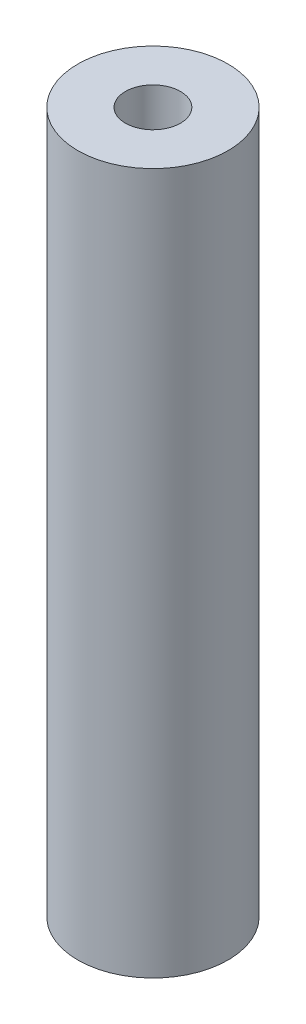
ISO-10303-21;
HEADER;
FILE_DESCRIPTION(('STEP AP214'),'2;1');
FILE_NAME('part.step','',(''),(''),'','','');
FILE_SCHEMA(('AUTOMOTIVE_DESIGN { 1 0 10303 214 1 1 1 1 }'));
ENDSEC;
DATA;
#1=APPLICATION_CONTEXT('core data for automotive mechanical design processes');
#2=APPLICATION_PROTOCOL_DEFINITION('international standard','automotive_design',2000,#1);
#3=PRODUCT_CONTEXT('',#1,'mechanical');
#4=PRODUCT('Part','Part','',(#3));
#5=PRODUCT_RELATED_PRODUCT_CATEGORY('part','',(#4));
#6=PRODUCT_DEFINITION_FORMATION('','',#4);
#7=PRODUCT_DEFINITION_CONTEXT('part definition',#1,'design');
#8=PRODUCT_DEFINITION('design','',#6,#7);
#9=PRODUCT_DEFINITION_SHAPE('','',#8);
#10=(LENGTH_UNIT() NAMED_UNIT(*) SI_UNIT(.MILLI.,.METRE.));
#11=(NAMED_UNIT(*) PLANE_ANGLE_UNIT() SI_UNIT($,.RADIAN.));
#12=(NAMED_UNIT(*) SI_UNIT($,.STERADIAN.) SOLID_ANGLE_UNIT());
#13=UNCERTAINTY_MEASURE_WITH_UNIT(LENGTH_MEASURE(1.E-05),#10,'distance_accuracy_value','');
#14=(GEOMETRIC_REPRESENTATION_CONTEXT(3) GLOBAL_UNCERTAINTY_ASSIGNED_CONTEXT((#13)) GLOBAL_UNIT_ASSIGNED_CONTEXT((#10,
#11,#12)) REPRESENTATION_CONTEXT('',''));
#15=CARTESIAN_POINT('',(0.,0.,0.));
#16=DIRECTION('',(0.,0.,1.));
#17=DIRECTION('',(1.,0.,0.));
#18=AXIS2_PLACEMENT_3D('',#15,#16,#17);
#19=CARTESIAN_POINT('',(738.258051732813,1022.68822275531,1161.21447507701));
#20=DIRECTION('',(0.,1.,0.));
#21=DIRECTION('',(0.,0.,1.));
#22=AXIS2_PLACEMENT_3D('',#19,#20,#21);
#23=PLANE('',#22);
#24=CARTESIAN_POINT('',(738.258051732813,1022.68822275531,1161.21447507701));
#25=DIRECTION('',(0.,1.,0.));
#26=DIRECTION('',(0.,0.,1.));
#27=AXIS2_PLACEMENT_3D('',#24,#25,#26);
#28=CIRCLE('',#27,7.49999999999993);
#29=CARTESIAN_POINT('',(738.258051732813,1022.68822275531,1168.71447507701));
#30=VERTEX_POINT('',#29);
#31=EDGE_CURVE('E10',#30,#30,#28,.T.);
#32=ORIENTED_EDGE('',*,*,#31,.T.);
#33=EDGE_LOOP('',(#32));
#34=FACE_BOUND('',#33,.T.);
#35=CARTESIAN_POINT('',(738.258051732813,1022.68822275531,1161.21447507701));
#36=DIRECTION('',(0.,1.,0.));
#37=DIRECTION('',(0.,0.,1.));
#38=AXIS2_PLACEMENT_3D('',#35,#36,#37);
#39=CIRCLE('',#38,2.75000000000002);
#40=CARTESIAN_POINT('',(738.258051732813,1022.68822275531,1163.96447507701));
#41=VERTEX_POINT('',#40);
#42=EDGE_CURVE('E48',#41,#41,#39,.T.);
#43=ORIENTED_EDGE('',*,*,#42,.F.);
#44=EDGE_LOOP('',(#43));
#45=FACE_BOUND('',#44,.T.);
#46=ADVANCED_FACE('F37',(#34,#45),#23,.T.);
#47=CARTESIAN_POINT('',(738.258051732813,952.688222755311,1161.21447507701));
#48=DIRECTION('',(0.,1.,0.));
#49=DIRECTION('',(0.,0.,1.));
#50=AXIS2_PLACEMENT_3D('',#47,#48,#49);
#51=PLANE('',#50);
#52=CARTESIAN_POINT('',(738.258051732813,952.688222755311,1161.21447507701));
#53=DIRECTION('',(0.,1.,0.));
#54=DIRECTION('',(0.,0.,1.));
#55=AXIS2_PLACEMENT_3D('',#52,#53,#54);
#56=CIRCLE('',#55,7.49999999999993);
#57=CARTESIAN_POINT('',(738.258051732813,952.688222755311,1168.71447507701));
#58=VERTEX_POINT('',#57);
#59=EDGE_CURVE('E41',#58,#58,#56,.T.);
#60=ORIENTED_EDGE('',*,*,#59,.F.);
#61=EDGE_LOOP('',(#60));
#62=FACE_BOUND('',#61,.T.);
#63=CARTESIAN_POINT('',(738.258051732813,952.688222755311,1161.21447507701));
#64=DIRECTION('',(0.,1.,0.));
#65=DIRECTION('',(0.,0.,1.));
#66=AXIS2_PLACEMENT_3D('',#63,#64,#65);
#67=CIRCLE('',#66,2.75000000000002);
#68=CARTESIAN_POINT('',(738.258051732813,952.688222755311,1163.96447507701));
#69=VERTEX_POINT('',#68);
#70=EDGE_CURVE('E50',#69,#69,#67,.T.);
#71=ORIENTED_EDGE('',*,*,#70,.T.);
#72=EDGE_LOOP('',(#71));
#73=FACE_BOUND('',#72,.T.);
#74=ADVANCED_FACE('F60',(#62,#73),#51,.F.);
#75=CARTESIAN_POINT('',(738.258051732813,1022.68822275531,1161.21447507701));
#76=DIRECTION('',(0.,-1.,0.));
#77=DIRECTION('',(0.,0.,-1.));
#78=AXIS2_PLACEMENT_3D('',#75,#76,#77);
#79=CYLINDRICAL_SURFACE('',#78,7.49999999999993);
#80=ORIENTED_EDGE('',*,*,#31,.F.);
#81=EDGE_LOOP('',(#80));
#82=FACE_BOUND('',#81,.T.);
#83=ORIENTED_EDGE('',*,*,#59,.T.);
#84=EDGE_LOOP('',(#83));
#85=FACE_BOUND('',#84,.T.);
#86=ADVANCED_FACE('F39',(#82,#85),#79,.T.);
#87=CARTESIAN_POINT('',(738.258051732813,1022.68822275531,1161.21447507701));
#88=DIRECTION('',(0.,-1.,0.));
#89=DIRECTION('',(0.,0.,-1.));
#90=AXIS2_PLACEMENT_3D('',#87,#88,#89);
#91=CYLINDRICAL_SURFACE('',#90,2.75000000000002);
#92=ORIENTED_EDGE('',*,*,#42,.T.);
#93=EDGE_LOOP('',(#92));
#94=FACE_BOUND('',#93,.T.);
#95=ORIENTED_EDGE('',*,*,#70,.F.);
#96=EDGE_LOOP('',(#95));
#97=FACE_BOUND('',#96,.T.);
#98=ADVANCED_FACE('F56',(#94,#97),#91,.F.);
#99=CLOSED_SHELL('',(#46,#74,#86,#98));
#100=MANIFOLD_SOLID_BREP('B2',#99);
#101=ADVANCED_BREP_SHAPE_REPRESENTATION('',(#18,#100),#14);
#102=SHAPE_DEFINITION_REPRESENTATION(#9,#101);
ENDSEC;
END-ISO-10303-21;
